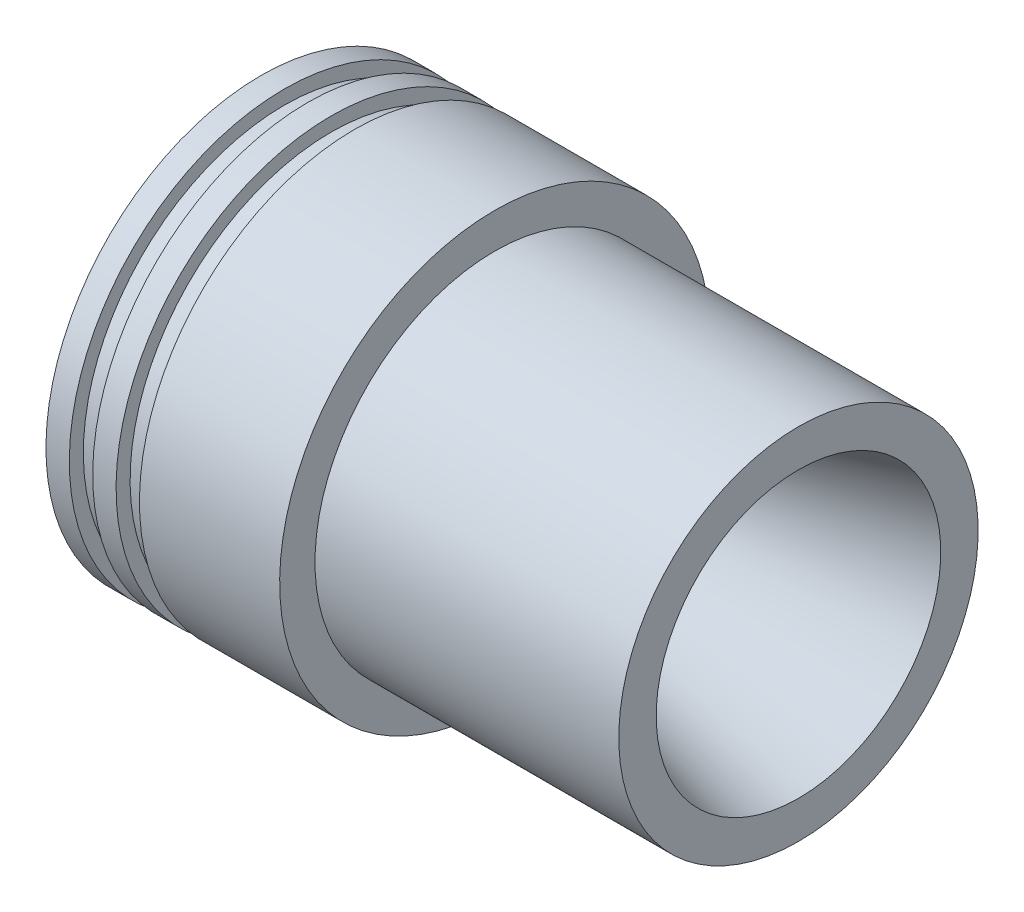
ISO-10303-21;
HEADER;
FILE_DESCRIPTION(('STEP AP214'),'2;1');
FILE_NAME('part.step','',(''),(''),'','','');
FILE_SCHEMA(('AUTOMOTIVE_DESIGN { 1 0 10303 214 1 1 1 1 }'));
ENDSEC;
DATA;
#1=APPLICATION_CONTEXT('core data for automotive mechanical design processes');
#2=APPLICATION_PROTOCOL_DEFINITION('international standard','automotive_design',2000,#1);
#3=PRODUCT_CONTEXT('',#1,'mechanical');
#4=PRODUCT('Part','Part','',(#3));
#5=PRODUCT_RELATED_PRODUCT_CATEGORY('part','',(#4));
#6=PRODUCT_DEFINITION_FORMATION('','',#4);
#7=PRODUCT_DEFINITION_CONTEXT('part definition',#1,'design');
#8=PRODUCT_DEFINITION('design','',#6,#7);
#9=PRODUCT_DEFINITION_SHAPE('','',#8);
#10=(LENGTH_UNIT() NAMED_UNIT(*) SI_UNIT(.MILLI.,.METRE.));
#11=(NAMED_UNIT(*) PLANE_ANGLE_UNIT() SI_UNIT($,.RADIAN.));
#12=(NAMED_UNIT(*) SI_UNIT($,.STERADIAN.) SOLID_ANGLE_UNIT());
#13=UNCERTAINTY_MEASURE_WITH_UNIT(LENGTH_MEASURE(1.E-05),#10,'distance_accuracy_value','');
#14=(GEOMETRIC_REPRESENTATION_CONTEXT(3) GLOBAL_UNCERTAINTY_ASSIGNED_CONTEXT((#13)) GLOBAL_UNIT_ASSIGNED_CONTEXT((#10,
#11,#12)) REPRESENTATION_CONTEXT('',''));
#15=CARTESIAN_POINT('',(0.,0.,0.));
#16=DIRECTION('',(0.,0.,1.));
#17=DIRECTION('',(1.,0.,0.));
#18=AXIS2_PLACEMENT_3D('',#15,#16,#17);
#19=CARTESIAN_POINT('',(-115.,36.5,0.));
#20=DIRECTION('',(-1.,0.,0.));
#21=DIRECTION('',(0.,-1.,0.));
#22=AXIS2_PLACEMENT_3D('',#19,#20,#21);
#23=PLANE('',#22);
#24=CARTESIAN_POINT('',(-115.,0.,0.));
#25=DIRECTION('',(1.,0.,0.));
#26=DIRECTION('',(0.,1.,0.));
#27=AXIS2_PLACEMENT_3D('',#24,#25,#26);
#28=CIRCLE('',#27,36.5);
#29=CARTESIAN_POINT('',(-115.,36.5,0.));
#30=VERTEX_POINT('',#29);
#31=EDGE_CURVE('E87',#30,#30,#28,.T.);
#32=ORIENTED_EDGE('',*,*,#31,.T.);
#33=EDGE_LOOP('',(#32));
#34=FACE_BOUND('',#33,.T.);
#35=CARTESIAN_POINT('',(-115.,0.,0.));
#36=DIRECTION('',(1.,0.,0.));
#37=DIRECTION('',(0.,1.,0.));
#38=AXIS2_PLACEMENT_3D('',#35,#36,#37);
#39=CIRCLE('',#38,46.);
#40=CARTESIAN_POINT('',(-115.,46.,0.));
#41=VERTEX_POINT('',#40);
#42=EDGE_CURVE('E10',#41,#41,#39,.T.);
#43=ORIENTED_EDGE('',*,*,#42,.F.);
#44=EDGE_LOOP('',(#43));
#45=FACE_BOUND('',#44,.T.);
#46=ADVANCED_FACE('F35',(#34,#45),#23,.T.);
#47=CARTESIAN_POINT('',(0.,0.,0.));
#48=DIRECTION('',(1.,0.,0.));
#49=DIRECTION('',(0.,1.,0.));
#50=AXIS2_PLACEMENT_3D('',#47,#48,#49);
#51=CYLINDRICAL_SURFACE('',#50,46.);
#52=ORIENTED_EDGE('',*,*,#42,.T.);
#53=EDGE_LOOP('',(#52));
#54=FACE_BOUND('',#53,.T.);
#55=CARTESIAN_POINT('',(-110.,0.,0.));
#56=DIRECTION('',(1.,0.,0.));
#57=DIRECTION('',(0.,1.,0.));
#58=AXIS2_PLACEMENT_3D('',#55,#56,#57);
#59=CIRCLE('',#58,46.);
#60=CARTESIAN_POINT('',(-110.,46.,0.));
#61=VERTEX_POINT('',#60);
#62=EDGE_CURVE('E41',#61,#61,#59,.T.);
#63=ORIENTED_EDGE('',*,*,#62,.F.);
#64=EDGE_LOOP('',(#63));
#65=FACE_BOUND('',#64,.T.);
#66=ADVANCED_FACE('F105',(#54,#65),#51,.T.);
#67=CARTESIAN_POINT('',(-110.,46.,0.));
#68=DIRECTION('',(1.,0.,0.));
#69=DIRECTION('',(0.,1.,0.));
#70=AXIS2_PLACEMENT_3D('',#67,#68,#69);
#71=PLANE('',#70);
#72=ORIENTED_EDGE('',*,*,#62,.T.);
#73=EDGE_LOOP('',(#72));
#74=FACE_BOUND('',#73,.T.);
#75=CARTESIAN_POINT('',(-110.,0.,0.));
#76=DIRECTION('',(1.,0.,0.));
#77=DIRECTION('',(0.,1.,0.));
#78=AXIS2_PLACEMENT_3D('',#75,#76,#77);
#79=CIRCLE('',#78,43.);
#80=CARTESIAN_POINT('',(-110.,43.,0.));
#81=VERTEX_POINT('',#80);
#82=EDGE_CURVE('E45',#81,#81,#79,.T.);
#83=ORIENTED_EDGE('',*,*,#82,.F.);
#84=EDGE_LOOP('',(#83));
#85=FACE_BOUND('',#84,.T.);
#86=ADVANCED_FACE('F109',(#74,#85),#71,.T.);
#87=CARTESIAN_POINT('',(0.,0.,0.));
#88=DIRECTION('',(1.,0.,0.));
#89=DIRECTION('',(0.,1.,0.));
#90=AXIS2_PLACEMENT_3D('',#87,#88,#89);
#91=CYLINDRICAL_SURFACE('',#90,43.);
#92=ORIENTED_EDGE('',*,*,#82,.T.);
#93=EDGE_LOOP('',(#92));
#94=FACE_BOUND('',#93,.T.);
#95=CARTESIAN_POINT('',(-105.,0.,0.));
#96=DIRECTION('',(1.,0.,0.));
#97=DIRECTION('',(0.,1.,0.));
#98=AXIS2_PLACEMENT_3D('',#95,#96,#97);
#99=CIRCLE('',#98,43.);
#100=CARTESIAN_POINT('',(-105.,43.,0.));
#101=VERTEX_POINT('',#100);
#102=EDGE_CURVE('E49',#101,#101,#99,.T.);
#103=ORIENTED_EDGE('',*,*,#102,.F.);
#104=EDGE_LOOP('',(#103));
#105=FACE_BOUND('',#104,.T.);
#106=ADVANCED_FACE('F113',(#94,#105),#91,.T.);
#107=CARTESIAN_POINT('',(-105.,43.,0.));
#108=DIRECTION('',(-1.,0.,0.));
#109=DIRECTION('',(0.,-1.,0.));
#110=AXIS2_PLACEMENT_3D('',#107,#108,#109);
#111=PLANE('',#110);
#112=ORIENTED_EDGE('',*,*,#102,.T.);
#113=EDGE_LOOP('',(#112));
#114=FACE_BOUND('',#113,.T.);
#115=CARTESIAN_POINT('',(-105.,0.,0.));
#116=DIRECTION('',(1.,0.,0.));
#117=DIRECTION('',(0.,1.,0.));
#118=AXIS2_PLACEMENT_3D('',#115,#116,#117);
#119=CIRCLE('',#118,46.);
#120=CARTESIAN_POINT('',(-105.,46.,0.));
#121=VERTEX_POINT('',#120);
#122=EDGE_CURVE('E54',#121,#121,#119,.T.);
#123=ORIENTED_EDGE('',*,*,#122,.F.);
#124=EDGE_LOOP('',(#123));
#125=FACE_BOUND('',#124,.T.);
#126=ADVANCED_FACE('F119',(#114,#125),#111,.T.);
#127=CARTESIAN_POINT('',(0.,0.,0.));
#128=DIRECTION('',(1.,0.,0.));
#129=DIRECTION('',(0.,1.,0.));
#130=AXIS2_PLACEMENT_3D('',#127,#128,#129);
#131=CYLINDRICAL_SURFACE('',#130,46.);
#132=ORIENTED_EDGE('',*,*,#122,.T.);
#133=EDGE_LOOP('',(#132));
#134=FACE_BOUND('',#133,.T.);
#135=CARTESIAN_POINT('',(-100.,0.,0.));
#136=DIRECTION('',(1.,0.,0.));
#137=DIRECTION('',(0.,1.,0.));
#138=AXIS2_PLACEMENT_3D('',#135,#136,#137);
#139=CIRCLE('',#138,46.);
#140=CARTESIAN_POINT('',(-100.,46.,0.));
#141=VERTEX_POINT('',#140);
#142=EDGE_CURVE('E57',#141,#141,#139,.T.);
#143=ORIENTED_EDGE('',*,*,#142,.F.);
#144=EDGE_LOOP('',(#143));
#145=FACE_BOUND('',#144,.T.);
#146=ADVANCED_FACE('F123',(#134,#145),#131,.T.);
#147=CARTESIAN_POINT('',(-100.,46.,0.));
#148=DIRECTION('',(1.,0.,0.));
#149=DIRECTION('',(0.,1.,0.));
#150=AXIS2_PLACEMENT_3D('',#147,#148,#149);
#151=PLANE('',#150);
#152=ORIENTED_EDGE('',*,*,#142,.T.);
#153=EDGE_LOOP('',(#152));
#154=FACE_BOUND('',#153,.T.);
#155=CARTESIAN_POINT('',(-100.,0.,0.));
#156=DIRECTION('',(1.,0.,0.));
#157=DIRECTION('',(0.,1.,0.));
#158=AXIS2_PLACEMENT_3D('',#155,#156,#157);
#159=CIRCLE('',#158,43.);
#160=CARTESIAN_POINT('',(-100.,43.,0.));
#161=VERTEX_POINT('',#160);
#162=EDGE_CURVE('E60',#161,#161,#159,.T.);
#163=ORIENTED_EDGE('',*,*,#162,.F.);
#164=EDGE_LOOP('',(#163));
#165=FACE_BOUND('',#164,.T.);
#166=ADVANCED_FACE('F127',(#154,#165),#151,.T.);
#167=CARTESIAN_POINT('',(0.,0.,0.));
#168=DIRECTION('',(1.,0.,0.));
#169=DIRECTION('',(0.,1.,0.));
#170=AXIS2_PLACEMENT_3D('',#167,#168,#169);
#171=CYLINDRICAL_SURFACE('',#170,43.);
#172=ORIENTED_EDGE('',*,*,#162,.T.);
#173=EDGE_LOOP('',(#172));
#174=FACE_BOUND('',#173,.T.);
#175=CARTESIAN_POINT('',(-95.,0.,0.));
#176=DIRECTION('',(1.,0.,0.));
#177=DIRECTION('',(0.,1.,0.));
#178=AXIS2_PLACEMENT_3D('',#175,#176,#177);
#179=CIRCLE('',#178,43.);
#180=CARTESIAN_POINT('',(-95.,43.,0.));
#181=VERTEX_POINT('',#180);
#182=EDGE_CURVE('E63',#181,#181,#179,.T.);
#183=ORIENTED_EDGE('',*,*,#182,.F.);
#184=EDGE_LOOP('',(#183));
#185=FACE_BOUND('',#184,.T.);
#186=ADVANCED_FACE('F131',(#174,#185),#171,.T.);
#187=CARTESIAN_POINT('',(-95.,43.,0.));
#188=DIRECTION('',(-1.,0.,0.));
#189=DIRECTION('',(0.,-1.,0.));
#190=AXIS2_PLACEMENT_3D('',#187,#188,#189);
#191=PLANE('',#190);
#192=ORIENTED_EDGE('',*,*,#182,.T.);
#193=EDGE_LOOP('',(#192));
#194=FACE_BOUND('',#193,.T.);
#195=CARTESIAN_POINT('',(-95.,0.,0.));
#196=DIRECTION('',(1.,0.,0.));
#197=DIRECTION('',(0.,1.,0.));
#198=AXIS2_PLACEMENT_3D('',#195,#196,#197);
#199=CIRCLE('',#198,46.);
#200=CARTESIAN_POINT('',(-95.,46.,0.));
#201=VERTEX_POINT('',#200);
#202=EDGE_CURVE('E66',#201,#201,#199,.T.);
#203=ORIENTED_EDGE('',*,*,#202,.F.);
#204=EDGE_LOOP('',(#203));
#205=FACE_BOUND('',#204,.T.);
#206=ADVANCED_FACE('F135',(#194,#205),#191,.T.);
#207=CARTESIAN_POINT('',(0.,0.,0.));
#208=DIRECTION('',(1.,0.,0.));
#209=DIRECTION('',(0.,1.,0.));
#210=AXIS2_PLACEMENT_3D('',#207,#208,#209);
#211=CYLINDRICAL_SURFACE('',#210,46.);
#212=ORIENTED_EDGE('',*,*,#202,.T.);
#213=EDGE_LOOP('',(#212));
#214=FACE_BOUND('',#213,.T.);
#215=CARTESIAN_POINT('',(-65.,0.,0.));
#216=DIRECTION('',(1.,0.,0.));
#217=DIRECTION('',(0.,1.,0.));
#218=AXIS2_PLACEMENT_3D('',#215,#216,#217);
#219=CIRCLE('',#218,46.);
#220=CARTESIAN_POINT('',(-65.,46.,0.));
#221=VERTEX_POINT('',#220);
#222=EDGE_CURVE('E69',#221,#221,#219,.T.);
#223=ORIENTED_EDGE('',*,*,#222,.F.);
#224=EDGE_LOOP('',(#223));
#225=FACE_BOUND('',#224,.T.);
#226=ADVANCED_FACE('F139',(#214,#225),#211,.T.);
#227=CARTESIAN_POINT('',(-65.,38.4436675587035,0.));
#228=DIRECTION('',(1.,0.,0.));
#229=DIRECTION('',(0.,1.,0.));
#230=AXIS2_PLACEMENT_3D('',#227,#228,#229);
#231=PLANE('',#230);
#232=ORIENTED_EDGE('',*,*,#222,.T.);
#233=EDGE_LOOP('',(#232));
#234=FACE_BOUND('',#233,.T.);
#235=CARTESIAN_POINT('',(-65.,0.,0.));
#236=DIRECTION('',(1.,0.,0.));
#237=DIRECTION('',(0.,1.,0.));
#238=AXIS2_PLACEMENT_3D('',#235,#236,#237);
#239=CIRCLE('',#238,38.4436675587035);
#240=CARTESIAN_POINT('',(-65.,38.4436675587035,0.));
#241=VERTEX_POINT('',#240);
#242=EDGE_CURVE('E72',#241,#241,#239,.T.);
#243=ORIENTED_EDGE('',*,*,#242,.F.);
#244=EDGE_LOOP('',(#243));
#245=FACE_BOUND('',#244,.T.);
#246=ADVANCED_FACE('F143',(#234,#245),#231,.T.);
#247=CARTESIAN_POINT('',(0.,0.,0.));
#248=DIRECTION('',(1.,0.,0.));
#249=DIRECTION('',(0.,1.,0.));
#250=AXIS2_PLACEMENT_3D('',#247,#248,#249);
#251=CYLINDRICAL_SURFACE('',#250,38.4436675587035);
#252=ORIENTED_EDGE('',*,*,#242,.T.);
#253=EDGE_LOOP('',(#252));
#254=FACE_BOUND('',#253,.T.);
#255=CARTESIAN_POINT('',(0.,0.,0.));
#256=DIRECTION('',(1.,0.,0.));
#257=DIRECTION('',(0.,1.,0.));
#258=AXIS2_PLACEMENT_3D('',#255,#256,#257);
#259=CIRCLE('',#258,38.4436675587035);
#260=CARTESIAN_POINT('',(0.,38.4436675587035,0.));
#261=VERTEX_POINT('',#260);
#262=EDGE_CURVE('E75',#261,#261,#259,.T.);
#263=ORIENTED_EDGE('',*,*,#262,.F.);
#264=EDGE_LOOP('',(#263));
#265=FACE_BOUND('',#264,.T.);
#266=ADVANCED_FACE('F147',(#254,#265),#251,.T.);
#267=CARTESIAN_POINT('',(0.,30.4436675587035,0.));
#268=DIRECTION('',(1.,0.,0.));
#269=DIRECTION('',(0.,1.,0.));
#270=AXIS2_PLACEMENT_3D('',#267,#268,#269);
#271=PLANE('',#270);
#272=ORIENTED_EDGE('',*,*,#262,.T.);
#273=EDGE_LOOP('',(#272));
#274=FACE_BOUND('',#273,.T.);
#275=CARTESIAN_POINT('',(0.,0.,0.));
#276=DIRECTION('',(1.,0.,0.));
#277=DIRECTION('',(0.,1.,0.));
#278=AXIS2_PLACEMENT_3D('',#275,#276,#277);
#279=CIRCLE('',#278,30.4436675587035);
#280=CARTESIAN_POINT('',(0.,30.4436675587035,0.));
#281=VERTEX_POINT('',#280);
#282=EDGE_CURVE('E78',#281,#281,#279,.T.);
#283=ORIENTED_EDGE('',*,*,#282,.F.);
#284=EDGE_LOOP('',(#283));
#285=FACE_BOUND('',#284,.T.);
#286=ADVANCED_FACE('F151',(#274,#285),#271,.T.);
#287=CARTESIAN_POINT('',(-70.6987298107775,0.,0.));
#288=DIRECTION('',(1.,0.,0.));
#289=DIRECTION('',(0.,1.,0.));
#290=AXIS2_PLACEMENT_3D('',#287,#288,#289);
#291=CONICAL_SURFACE('',#290,11.5,0.261799387799143);
#292=ORIENTED_EDGE('',*,*,#282,.T.);
#293=EDGE_LOOP('',(#292));
#294=FACE_BOUND('',#293,.T.);
#295=CARTESIAN_POINT('',(-70.6987298107775,0.,0.));
#296=DIRECTION('',(1.,0.,0.));
#297=DIRECTION('',(0.,1.,0.));
#298=AXIS2_PLACEMENT_3D('',#295,#296,#297);
#299=CIRCLE('',#298,11.5);
#300=CARTESIAN_POINT('',(-70.6987298107775,11.5,0.));
#301=VERTEX_POINT('',#300);
#302=EDGE_CURVE('E81',#301,#301,#299,.T.);
#303=ORIENTED_EDGE('',*,*,#302,.F.);
#304=EDGE_LOOP('',(#303));
#305=FACE_BOUND('',#304,.T.);
#306=ADVANCED_FACE('F101',(#294,#305),#291,.F.);
#307=CARTESIAN_POINT('',(0.,0.,0.));
#308=DIRECTION('',(1.,0.,0.));
#309=DIRECTION('',(0.,1.,0.));
#310=AXIS2_PLACEMENT_3D('',#307,#308,#309);
#311=CYLINDRICAL_SURFACE('',#310,11.5);
#312=ORIENTED_EDGE('',*,*,#302,.T.);
#313=EDGE_LOOP('',(#312));
#314=FACE_BOUND('',#313,.T.);
#315=CARTESIAN_POINT('',(-71.6987298107775,0.,0.));
#316=DIRECTION('',(1.,0.,0.));
#317=DIRECTION('',(0.,1.,0.));
#318=AXIS2_PLACEMENT_3D('',#315,#316,#317);
#319=CIRCLE('',#318,11.5);
#320=CARTESIAN_POINT('',(-71.6987298107775,11.5,0.));
#321=VERTEX_POINT('',#320);
#322=EDGE_CURVE('E84',#321,#321,#319,.T.);
#323=ORIENTED_EDGE('',*,*,#322,.F.);
#324=EDGE_LOOP('',(#323));
#325=FACE_BOUND('',#324,.T.);
#326=ADVANCED_FACE('F95',(#314,#325),#311,.F.);
#327=CARTESIAN_POINT('',(-115.,0.,0.));
#328=DIRECTION('',(-1.,0.,0.));
#329=DIRECTION('',(0.,-1.,0.));
#330=AXIS2_PLACEMENT_3D('',#327,#328,#329);
#331=CONICAL_SURFACE('',#330,36.5,0.523598775598293);
#332=ORIENTED_EDGE('',*,*,#322,.T.);
#333=EDGE_LOOP('',(#332));
#334=FACE_BOUND('',#333,.T.);
#335=ORIENTED_EDGE('',*,*,#31,.F.);
#336=EDGE_LOOP('',(#335));
#337=FACE_BOUND('',#336,.T.);
#338=ADVANCED_FACE('F93',(#334,#337),#331,.F.);
#339=CLOSED_SHELL('',(#46,#66,#86,#106,#126,#146,#166,#186,#206,#226,#246,#266,#286,#306,#326,#338));
#340=MANIFOLD_SOLID_BREP('B2',#339);
#341=ADVANCED_BREP_SHAPE_REPRESENTATION('',(#18,#340),#14);
#342=SHAPE_DEFINITION_REPRESENTATION(#9,#341);
ENDSEC;
END-ISO-10303-21;
